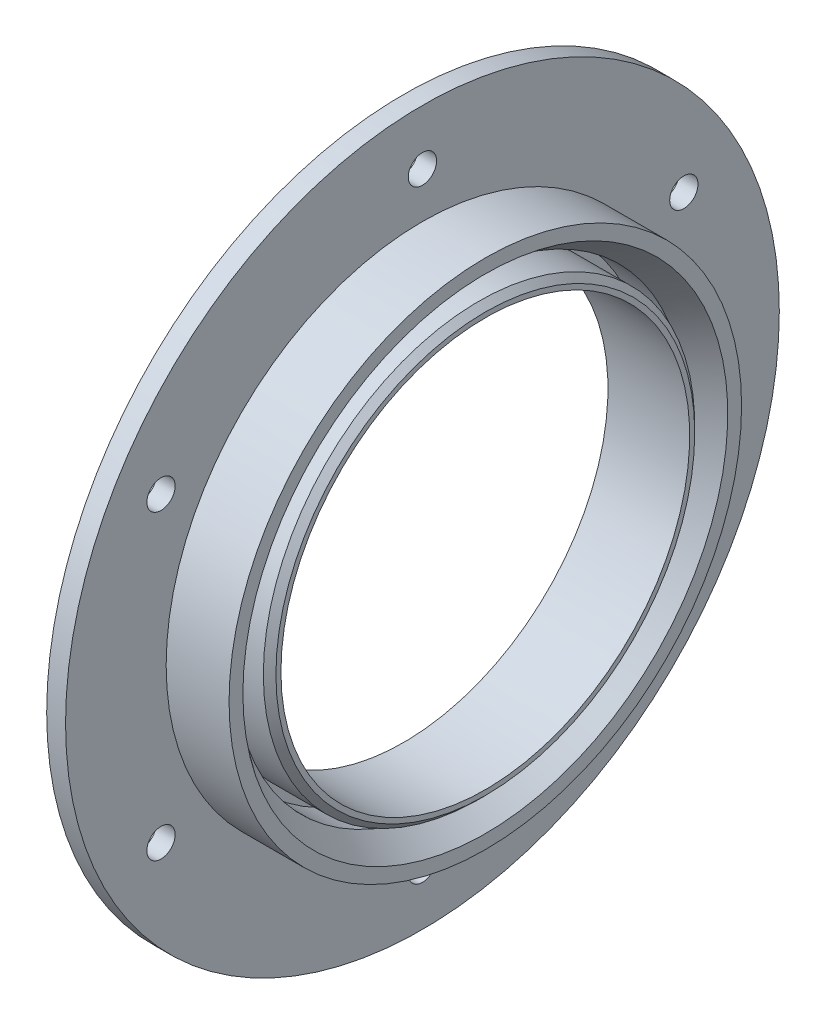
ISO-10303-21;
HEADER;
FILE_DESCRIPTION(('STEP AP214'),'2;1');
FILE_NAME('part.step','',(''),(''),'','','');
FILE_SCHEMA(('AUTOMOTIVE_DESIGN { 1 0 10303 214 1 1 1 1 }'));
ENDSEC;
DATA;
#1=APPLICATION_CONTEXT('core data for automotive mechanical design processes');
#2=APPLICATION_PROTOCOL_DEFINITION('international standard','automotive_design',2000,#1);
#3=PRODUCT_CONTEXT('',#1,'mechanical');
#4=PRODUCT('Part','Part','',(#3));
#5=PRODUCT_RELATED_PRODUCT_CATEGORY('part','',(#4));
#6=PRODUCT_DEFINITION_FORMATION('','',#4);
#7=PRODUCT_DEFINITION_CONTEXT('part definition',#1,'design');
#8=PRODUCT_DEFINITION('design','',#6,#7);
#9=PRODUCT_DEFINITION_SHAPE('','',#8);
#10=(LENGTH_UNIT() NAMED_UNIT(*) SI_UNIT(.MILLI.,.METRE.));
#11=(NAMED_UNIT(*) PLANE_ANGLE_UNIT() SI_UNIT($,.RADIAN.));
#12=(NAMED_UNIT(*) SI_UNIT($,.STERADIAN.) SOLID_ANGLE_UNIT());
#13=UNCERTAINTY_MEASURE_WITH_UNIT(LENGTH_MEASURE(1.E-05),#10,'distance_accuracy_value','');
#14=(GEOMETRIC_REPRESENTATION_CONTEXT(3) GLOBAL_UNCERTAINTY_ASSIGNED_CONTEXT((#13)) GLOBAL_UNIT_ASSIGNED_CONTEXT((#10,
#11,#12)) REPRESENTATION_CONTEXT('',''));
#15=CARTESIAN_POINT('',(0.,0.,0.));
#16=DIRECTION('',(0.,0.,1.));
#17=DIRECTION('',(1.,0.,0.));
#18=AXIS2_PLACEMENT_3D('',#15,#16,#17);
#19=CARTESIAN_POINT('',(0.,56.75,0.));
#20=DIRECTION('',(1.,0.,0.));
#21=DIRECTION('',(0.,0.,-1.));
#22=AXIS2_PLACEMENT_3D('',#19,#20,#21);
#23=PLANE('',#22);
#24=CARTESIAN_POINT('',(0.,24.0000000000005,41.5692193816528));
#25=DIRECTION('',(1.,0.,0.));
#26=DIRECTION('',(0.,0.,-1.));
#27=AXIS2_PLACEMENT_3D('',#24,#25,#26);
#28=CIRCLE('',#27,2.25);
#29=CARTESIAN_POINT('',(0.,24.0000000000005,39.3192193816528));
#30=VERTEX_POINT('',#29);
#31=EDGE_CURVE('E107',#30,#30,#28,.T.);
#32=ORIENTED_EDGE('',*,*,#31,.T.);
#33=EDGE_LOOP('',(#32));
#34=FACE_BOUND('',#33,.T.);
#35=CARTESIAN_POINT('',(0.,-23.9999999999996,41.5692193816533));
#36=DIRECTION('',(1.,0.,0.));
#37=DIRECTION('',(0.,0.,-1.));
#38=AXIS2_PLACEMENT_3D('',#35,#36,#37);
#39=CIRCLE('',#38,2.25);
#40=CARTESIAN_POINT('',(0.,-23.9999999999996,39.3192193816533));
#41=VERTEX_POINT('',#40);
#42=EDGE_CURVE('E101',#41,#41,#39,.T.);
#43=ORIENTED_EDGE('',*,*,#42,.T.);
#44=EDGE_LOOP('',(#43));
#45=FACE_BOUND('',#44,.T.);
#46=CARTESIAN_POINT('',(0.,-48.,0.));
#47=DIRECTION('',(1.,0.,0.));
#48=DIRECTION('',(0.,0.,-1.));
#49=AXIS2_PLACEMENT_3D('',#46,#47,#48);
#50=CIRCLE('',#49,2.25);
#51=CARTESIAN_POINT('',(0.,-48.,-2.25));
#52=VERTEX_POINT('',#51);
#53=EDGE_CURVE('E95',#52,#52,#50,.T.);
#54=ORIENTED_EDGE('',*,*,#53,.T.);
#55=EDGE_LOOP('',(#54));
#56=FACE_BOUND('',#55,.T.);
#57=CARTESIAN_POINT('',(0.,-24.0000000000002,-41.5692193816529));
#58=DIRECTION('',(1.,0.,0.));
#59=DIRECTION('',(0.,0.,-1.));
#60=AXIS2_PLACEMENT_3D('',#57,#58,#59);
#61=CIRCLE('',#60,2.25);
#62=CARTESIAN_POINT('',(0.,-24.0000000000002,-43.8192193816529));
#63=VERTEX_POINT('',#62);
#64=EDGE_CURVE('E89',#63,#63,#61,.T.);
#65=ORIENTED_EDGE('',*,*,#64,.T.);
#66=EDGE_LOOP('',(#65));
#67=FACE_BOUND('',#66,.T.);
#68=CARTESIAN_POINT('',(0.,23.9999999999999,-41.5692193816531));
#69=DIRECTION('',(1.,0.,0.));
#70=DIRECTION('',(0.,0.,-1.));
#71=AXIS2_PLACEMENT_3D('',#68,#69,#70);
#72=CIRCLE('',#71,2.25);
#73=CARTESIAN_POINT('',(0.,23.9999999999999,-43.8192193816531));
#74=VERTEX_POINT('',#73);
#75=EDGE_CURVE('E83',#74,#74,#72,.T.);
#76=ORIENTED_EDGE('',*,*,#75,.T.);
#77=EDGE_LOOP('',(#76));
#78=FACE_BOUND('',#77,.T.);
#79=CARTESIAN_POINT('',(0.,48.,0.));
#80=DIRECTION('',(1.,0.,0.));
#81=DIRECTION('',(0.,0.,-1.));
#82=AXIS2_PLACEMENT_3D('',#79,#80,#81);
#83=CIRCLE('',#82,2.25);
#84=CARTESIAN_POINT('',(0.,48.,-2.25));
#85=VERTEX_POINT('',#84);
#86=EDGE_CURVE('E77',#85,#85,#83,.T.);
#87=ORIENTED_EDGE('',*,*,#86,.T.);
#88=EDGE_LOOP('',(#87));
#89=FACE_BOUND('',#88,.T.);
#90=CARTESIAN_POINT('',(0.,0.,0.));
#91=DIRECTION('',(-1.,0.,0.));
#92=DIRECTION('',(0.,0.,1.));
#93=AXIS2_PLACEMENT_3D('',#90,#91,#92);
#94=CIRCLE('',#93,32.5);
#95=CARTESIAN_POINT('',(0.,0.,32.5));
#96=VERTEX_POINT('',#95);
#97=EDGE_CURVE('E53',#96,#96,#94,.T.);
#98=ORIENTED_EDGE('',*,*,#97,.F.);
#99=EDGE_LOOP('',(#98));
#100=FACE_BOUND('',#99,.T.);
#101=CARTESIAN_POINT('',(0.,0.,0.));
#102=DIRECTION('',(-1.,0.,0.));
#103=DIRECTION('',(0.,0.,1.));
#104=AXIS2_PLACEMENT_3D('',#101,#102,#103);
#105=CIRCLE('',#104,56.75);
#106=CARTESIAN_POINT('',(0.,0.,56.75));
#107=VERTEX_POINT('',#106);
#108=EDGE_CURVE('E74',#107,#107,#105,.T.);
#109=ORIENTED_EDGE('',*,*,#108,.T.);
#110=EDGE_LOOP('',(#109));
#111=FACE_BOUND('',#110,.T.);
#112=ADVANCED_FACE('F33',(#34,#45,#56,#67,#78,#89,#100,#111),#23,.F.);
#113=CARTESIAN_POINT('',(0.,0.,0.));
#114=DIRECTION('',(-1.,0.,0.));
#115=DIRECTION('',(0.,0.,1.));
#116=AXIS2_PLACEMENT_3D('',#113,#114,#115);
#117=CYLINDRICAL_SURFACE('',#116,32.5);
#118=CARTESIAN_POINT('',(13.,0.,0.));
#119=DIRECTION('',(-1.,0.,0.));
#120=DIRECTION('',(0.,0.,1.));
#121=AXIS2_PLACEMENT_3D('',#118,#119,#120);
#122=CIRCLE('',#121,32.5);
#123=CARTESIAN_POINT('',(13.,0.,32.5));
#124=VERTEX_POINT('',#123);
#125=EDGE_CURVE('E56',#124,#124,#122,.T.);
#126=ORIENTED_EDGE('',*,*,#125,.F.);
#127=EDGE_LOOP('',(#126));
#128=FACE_BOUND('',#127,.T.);
#129=ORIENTED_EDGE('',*,*,#97,.T.);
#130=EDGE_LOOP('',(#129));
#131=FACE_BOUND('',#130,.T.);
#132=ADVANCED_FACE('F154',(#128,#131),#117,.F.);
#133=CARTESIAN_POINT('',(13.,32.5,0.));
#134=DIRECTION('',(-1.,0.,0.));
#135=DIRECTION('',(0.,0.,1.));
#136=AXIS2_PLACEMENT_3D('',#133,#134,#135);
#137=PLANE('',#136);
#138=CARTESIAN_POINT('',(13.,0.,0.));
#139=DIRECTION('',(-1.,0.,0.));
#140=DIRECTION('',(0.,0.,1.));
#141=AXIS2_PLACEMENT_3D('',#138,#139,#140);
#142=CIRCLE('',#141,33.3);
#143=CARTESIAN_POINT('',(13.,0.,33.3));
#144=VERTEX_POINT('',#143);
#145=EDGE_CURVE('E10',#144,#144,#142,.F.);
#146=ORIENTED_EDGE('',*,*,#145,.T.);
#147=EDGE_LOOP('',(#146));
#148=FACE_BOUND('',#147,.T.);
#149=ORIENTED_EDGE('',*,*,#125,.T.);
#150=EDGE_LOOP('',(#149));
#151=FACE_BOUND('',#150,.T.);
#152=ADVANCED_FACE('F160',(#148,#151),#137,.F.);
#153=CARTESIAN_POINT('',(0.,0.,0.));
#154=DIRECTION('',(-1.,0.,0.));
#155=DIRECTION('',(0.,0.,1.));
#156=AXIS2_PLACEMENT_3D('',#153,#154,#155);
#157=CYLINDRICAL_SURFACE('',#156,34.3);
#158=CARTESIAN_POINT('',(12.,0.,0.));
#159=DIRECTION('',(-1.,0.,0.));
#160=DIRECTION('',(0.,0.,1.));
#161=AXIS2_PLACEMENT_3D('',#158,#159,#160);
#162=CIRCLE('',#161,34.3);
#163=CARTESIAN_POINT('',(12.,0.,34.3));
#164=VERTEX_POINT('',#163);
#165=EDGE_CURVE('E40',#164,#164,#162,.T.);
#166=ORIENTED_EDGE('',*,*,#165,.T.);
#167=EDGE_LOOP('',(#166));
#168=FACE_BOUND('',#167,.T.);
#169=CARTESIAN_POINT('',(2.99999999999999,0.,0.));
#170=DIRECTION('',(-1.,0.,0.));
#171=DIRECTION('',(0.,0.,1.));
#172=AXIS2_PLACEMENT_3D('',#169,#170,#171);
#173=CIRCLE('',#172,34.3);
#174=CARTESIAN_POINT('',(2.99999999999999,0.,34.3));
#175=VERTEX_POINT('',#174);
#176=EDGE_CURVE('E59',#175,#175,#173,.T.);
#177=ORIENTED_EDGE('',*,*,#176,.F.);
#178=EDGE_LOOP('',(#177));
#179=FACE_BOUND('',#178,.T.);
#180=ADVANCED_FACE('F184',(#168,#179),#157,.T.);
#181=CARTESIAN_POINT('',(2.99999999999999,34.3,0.));
#182=DIRECTION('',(-1.,0.,0.));
#183=DIRECTION('',(0.,0.,1.));
#184=AXIS2_PLACEMENT_3D('',#181,#182,#183);
#185=PLANE('',#184);
#186=CARTESIAN_POINT('',(3.,0.,0.));
#187=DIRECTION('',(-1.,0.,0.));
#188=DIRECTION('',(0.,0.,1.));
#189=AXIS2_PLACEMENT_3D('',#186,#187,#188);
#190=CIRCLE('',#189,35.75);
#191=CARTESIAN_POINT('',(3.,0.,35.75));
#192=VERTEX_POINT('',#191);
#193=EDGE_CURVE('E62',#192,#192,#190,.T.);
#194=ORIENTED_EDGE('',*,*,#193,.F.);
#195=EDGE_LOOP('',(#194));
#196=FACE_BOUND('',#195,.T.);
#197=ORIENTED_EDGE('',*,*,#176,.T.);
#198=EDGE_LOOP('',(#197));
#199=FACE_BOUND('',#198,.T.);
#200=ADVANCED_FACE('F150',(#196,#199),#185,.F.);
#201=CARTESIAN_POINT('',(0.,0.,0.));
#202=DIRECTION('',(-1.,0.,0.));
#203=DIRECTION('',(0.,0.,1.));
#204=AXIS2_PLACEMENT_3D('',#201,#202,#203);
#205=CYLINDRICAL_SURFACE('',#204,35.75);
#206=CARTESIAN_POINT('',(8.99999999999997,0.,0.));
#207=DIRECTION('',(-1.,0.,0.));
#208=DIRECTION('',(0.,0.,1.));
#209=AXIS2_PLACEMENT_3D('',#206,#207,#208);
#210=CIRCLE('',#209,35.75);
#211=CARTESIAN_POINT('',(8.99999999999997,0.,35.75));
#212=VERTEX_POINT('',#211);
#213=EDGE_CURVE('E44',#212,#212,#210,.F.);
#214=ORIENTED_EDGE('',*,*,#213,.T.);
#215=EDGE_LOOP('',(#214));
#216=FACE_BOUND('',#215,.T.);
#217=ORIENTED_EDGE('',*,*,#193,.T.);
#218=EDGE_LOOP('',(#217));
#219=FACE_BOUND('',#218,.T.);
#220=ADVANCED_FACE('F144',(#216,#219),#205,.F.);
#221=CARTESIAN_POINT('',(13.,35.75,0.));
#222=DIRECTION('',(-1.,0.,0.));
#223=DIRECTION('',(0.,0.,1.));
#224=AXIS2_PLACEMENT_3D('',#221,#222,#223);
#225=PLANE('',#224);
#226=CARTESIAN_POINT('',(13.,0.,0.));
#227=DIRECTION('',(-1.,0.,0.));
#228=DIRECTION('',(0.,0.,1.));
#229=AXIS2_PLACEMENT_3D('',#226,#227,#228);
#230=CIRCLE('',#229,38.5508301528388);
#231=CARTESIAN_POINT('',(13.,0.,38.5508301528388));
#232=VERTEX_POINT('',#231);
#233=EDGE_CURVE('E48',#232,#232,#230,.T.);
#234=ORIENTED_EDGE('',*,*,#233,.T.);
#235=EDGE_LOOP('',(#234));
#236=FACE_BOUND('',#235,.T.);
#237=CARTESIAN_POINT('',(13.,0.,0.));
#238=DIRECTION('',(-1.,0.,0.));
#239=DIRECTION('',(0.,0.,1.));
#240=AXIS2_PLACEMENT_3D('',#237,#238,#239);
#241=CIRCLE('',#240,40.75);
#242=CARTESIAN_POINT('',(13.,0.,40.75));
#243=VERTEX_POINT('',#242);
#244=EDGE_CURVE('E65',#243,#243,#241,.T.);
#245=ORIENTED_EDGE('',*,*,#244,.F.);
#246=EDGE_LOOP('',(#245));
#247=FACE_BOUND('',#246,.T.);
#248=ADVANCED_FACE('F139',(#236,#247),#225,.F.);
#249=CARTESIAN_POINT('',(0.,0.,0.));
#250=DIRECTION('',(-1.,0.,0.));
#251=DIRECTION('',(0.,0.,1.));
#252=AXIS2_PLACEMENT_3D('',#249,#250,#251);
#253=CYLINDRICAL_SURFACE('',#252,40.75);
#254=CARTESIAN_POINT('',(3.,0.,0.));
#255=DIRECTION('',(-1.,0.,0.));
#256=DIRECTION('',(0.,0.,1.));
#257=AXIS2_PLACEMENT_3D('',#254,#255,#256);
#258=CIRCLE('',#257,40.75);
#259=CARTESIAN_POINT('',(3.,0.,40.75));
#260=VERTEX_POINT('',#259);
#261=EDGE_CURVE('E68',#260,#260,#258,.T.);
#262=ORIENTED_EDGE('',*,*,#261,.F.);
#263=EDGE_LOOP('',(#262));
#264=FACE_BOUND('',#263,.T.);
#265=ORIENTED_EDGE('',*,*,#244,.T.);
#266=EDGE_LOOP('',(#265));
#267=FACE_BOUND('',#266,.T.);
#268=ADVANCED_FACE('F121',(#264,#267),#253,.T.);
#269=CARTESIAN_POINT('',(3.,40.75,0.));
#270=DIRECTION('',(-1.,0.,0.));
#271=DIRECTION('',(0.,0.,1.));
#272=AXIS2_PLACEMENT_3D('',#269,#270,#271);
#273=PLANE('',#272);
#274=CARTESIAN_POINT('',(3.,24.0000000000005,41.5692193816528));
#275=DIRECTION('',(1.,0.,0.));
#276=DIRECTION('',(0.,0.866025403784433,-0.50000000000001));
#277=AXIS2_PLACEMENT_3D('',#274,#275,#276);
#278=CIRCLE('',#277,2.25);
#279=CARTESIAN_POINT('',(3.,25.9485571585155,40.4442193816528));
#280=VERTEX_POINT('',#279);
#281=EDGE_CURVE('E110',#280,#280,#278,.T.);
#282=ORIENTED_EDGE('',*,*,#281,.F.);
#283=EDGE_LOOP('',(#282));
#284=FACE_BOUND('',#283,.T.);
#285=CARTESIAN_POINT('',(3.,-23.9999999999996,41.5692193816533));
#286=DIRECTION('',(1.,0.,0.));
#287=DIRECTION('',(0.,0.866025403784443,0.499999999999992));
#288=AXIS2_PLACEMENT_3D('',#285,#286,#287);
#289=CIRCLE('',#288,2.25);
#290=CARTESIAN_POINT('',(3.,-22.0514428414846,42.6942193816533));
#291=VERTEX_POINT('',#290);
#292=EDGE_CURVE('E104',#291,#291,#289,.T.);
#293=ORIENTED_EDGE('',*,*,#292,.F.);
#294=EDGE_LOOP('',(#293));
#295=FACE_BOUND('',#294,.T.);
#296=CARTESIAN_POINT('',(3.,-48.,0.));
#297=DIRECTION('',(1.,0.,0.));
#298=DIRECTION('',(0.,0.,1.));
#299=AXIS2_PLACEMENT_3D('',#296,#297,#298);
#300=CIRCLE('',#299,2.25);
#301=CARTESIAN_POINT('',(3.,-48.,2.25));
#302=VERTEX_POINT('',#301);
#303=EDGE_CURVE('E98',#302,#302,#300,.T.);
#304=ORIENTED_EDGE('',*,*,#303,.F.);
#305=EDGE_LOOP('',(#304));
#306=FACE_BOUND('',#305,.T.);
#307=CARTESIAN_POINT('',(3.,-24.0000000000002,-41.5692193816529));
#308=DIRECTION('',(1.,0.,0.));
#309=DIRECTION('',(0.,-0.866025403784436,0.500000000000004));
#310=AXIS2_PLACEMENT_3D('',#307,#308,#309);
#311=CIRCLE('',#310,2.25);
#312=CARTESIAN_POINT('',(3.,-25.9485571585152,-40.4442193816529));
#313=VERTEX_POINT('',#312);
#314=EDGE_CURVE('E92',#313,#313,#311,.T.);
#315=ORIENTED_EDGE('',*,*,#314,.F.);
#316=EDGE_LOOP('',(#315));
#317=FACE_BOUND('',#316,.T.);
#318=CARTESIAN_POINT('',(3.,23.9999999999999,-41.5692193816531));
#319=DIRECTION('',(1.,0.,0.));
#320=DIRECTION('',(0.,-0.86602540378444,-0.499999999999998));
#321=AXIS2_PLACEMENT_3D('',#318,#319,#320);
#322=CIRCLE('',#321,2.25);
#323=CARTESIAN_POINT('',(3.,22.0514428414849,-42.6942193816531));
#324=VERTEX_POINT('',#323);
#325=EDGE_CURVE('E86',#324,#324,#322,.T.);
#326=ORIENTED_EDGE('',*,*,#325,.F.);
#327=EDGE_LOOP('',(#326));
#328=FACE_BOUND('',#327,.T.);
#329=CARTESIAN_POINT('',(3.,48.,0.));
#330=DIRECTION('',(1.,0.,0.));
#331=DIRECTION('',(0.,0.,-1.));
#332=AXIS2_PLACEMENT_3D('',#329,#330,#331);
#333=CIRCLE('',#332,2.25);
#334=CARTESIAN_POINT('',(3.,48.,-2.25));
#335=VERTEX_POINT('',#334);
#336=EDGE_CURVE('E80',#335,#335,#333,.T.);
#337=ORIENTED_EDGE('',*,*,#336,.F.);
#338=EDGE_LOOP('',(#337));
#339=FACE_BOUND('',#338,.T.);
#340=CARTESIAN_POINT('',(3.,0.,0.));
#341=DIRECTION('',(-1.,0.,0.));
#342=DIRECTION('',(0.,0.,1.));
#343=AXIS2_PLACEMENT_3D('',#340,#341,#342);
#344=CIRCLE('',#343,56.75);
#345=CARTESIAN_POINT('',(3.,0.,56.75));
#346=VERTEX_POINT('',#345);
#347=EDGE_CURVE('E71',#346,#346,#344,.T.);
#348=ORIENTED_EDGE('',*,*,#347,.F.);
#349=EDGE_LOOP('',(#348));
#350=FACE_BOUND('',#349,.T.);
#351=ORIENTED_EDGE('',*,*,#261,.T.);
#352=EDGE_LOOP('',(#351));
#353=FACE_BOUND('',#352,.T.);
#354=ADVANCED_FACE('F117',(#284,#295,#306,#317,#328,#339,#350,#353),#273,.F.);
#355=CARTESIAN_POINT('',(0.,0.,0.));
#356=DIRECTION('',(-1.,0.,0.));
#357=DIRECTION('',(0.,0.,1.));
#358=AXIS2_PLACEMENT_3D('',#355,#356,#357);
#359=CYLINDRICAL_SURFACE('',#358,56.75);
#360=ORIENTED_EDGE('',*,*,#108,.F.);
#361=EDGE_LOOP('',(#360));
#362=FACE_BOUND('',#361,.T.);
#363=ORIENTED_EDGE('',*,*,#347,.T.);
#364=EDGE_LOOP('',(#363));
#365=FACE_BOUND('',#364,.T.);
#366=ADVANCED_FACE('F120',(#362,#365),#359,.T.);
#367=CARTESIAN_POINT('',(13.,0.,0.));
#368=DIRECTION('',(1.,0.,0.));
#369=DIRECTION('',(0.,0.,-1.));
#370=AXIS2_PLACEMENT_3D('',#367,#368,#369);
#371=CONICAL_SURFACE('',#370,38.5508301528388,0.610865238198012);
#372=ORIENTED_EDGE('',*,*,#213,.F.);
#373=EDGE_LOOP('',(#372));
#374=FACE_BOUND('',#373,.T.);
#375=ORIENTED_EDGE('',*,*,#233,.F.);
#376=EDGE_LOOP('',(#375));
#377=FACE_BOUND('',#376,.T.);
#378=ADVANCED_FACE('F165',(#374,#377),#371,.F.);
#379=CARTESIAN_POINT('',(12.,0.,0.));
#380=DIRECTION('',(-1.,0.,0.));
#381=DIRECTION('',(0.,0.,1.));
#382=AXIS2_PLACEMENT_3D('',#379,#380,#381);
#383=CONICAL_SURFACE('',#382,34.3,0.785398163397445);
#384=ORIENTED_EDGE('',*,*,#145,.F.);
#385=EDGE_LOOP('',(#384));
#386=FACE_BOUND('',#385,.T.);
#387=ORIENTED_EDGE('',*,*,#165,.F.);
#388=EDGE_LOOP('',(#387));
#389=FACE_BOUND('',#388,.T.);
#390=ADVANCED_FACE('F35',(#386,#389),#383,.T.);
#391=CARTESIAN_POINT('',(-7.,48.,0.));
#392=DIRECTION('',(1.,0.,0.));
#393=DIRECTION('',(0.,0.,-1.));
#394=AXIS2_PLACEMENT_3D('',#391,#392,#393);
#395=CYLINDRICAL_SURFACE('',#394,2.25);
#396=ORIENTED_EDGE('',*,*,#336,.T.);
#397=EDGE_LOOP('',(#396));
#398=FACE_BOUND('',#397,.T.);
#399=ORIENTED_EDGE('',*,*,#86,.F.);
#400=EDGE_LOOP('',(#399));
#401=FACE_BOUND('',#400,.T.);
#402=ADVANCED_FACE('F172',(#398,#401),#395,.F.);
#403=CARTESIAN_POINT('',(-7.,23.9999999999999,-41.5692193816531));
#404=DIRECTION('',(1.,0.,0.));
#405=DIRECTION('',(0.,0.,-1.));
#406=AXIS2_PLACEMENT_3D('',#403,#404,#405);
#407=CYLINDRICAL_SURFACE('',#406,2.25);
#408=ORIENTED_EDGE('',*,*,#325,.T.);
#409=EDGE_LOOP('',(#408));
#410=FACE_BOUND('',#409,.T.);
#411=ORIENTED_EDGE('',*,*,#75,.F.);
#412=EDGE_LOOP('',(#411));
#413=FACE_BOUND('',#412,.T.);
#414=ADVANCED_FACE('F257',(#410,#413),#407,.F.);
#415=CARTESIAN_POINT('',(-7.,-24.0000000000002,-41.5692193816529));
#416=DIRECTION('',(1.,0.,0.));
#417=DIRECTION('',(0.,0.,-1.));
#418=AXIS2_PLACEMENT_3D('',#415,#416,#417);
#419=CYLINDRICAL_SURFACE('',#418,2.25);
#420=ORIENTED_EDGE('',*,*,#314,.T.);
#421=EDGE_LOOP('',(#420));
#422=FACE_BOUND('',#421,.T.);
#423=ORIENTED_EDGE('',*,*,#64,.F.);
#424=EDGE_LOOP('',(#423));
#425=FACE_BOUND('',#424,.T.);
#426=ADVANCED_FACE('F266',(#422,#425),#419,.F.);
#427=CARTESIAN_POINT('',(-7.,-48.,0.));
#428=DIRECTION('',(1.,0.,0.));
#429=DIRECTION('',(0.,0.,-1.));
#430=AXIS2_PLACEMENT_3D('',#427,#428,#429);
#431=CYLINDRICAL_SURFACE('',#430,2.25);
#432=ORIENTED_EDGE('',*,*,#303,.T.);
#433=EDGE_LOOP('',(#432));
#434=FACE_BOUND('',#433,.T.);
#435=ORIENTED_EDGE('',*,*,#53,.F.);
#436=EDGE_LOOP('',(#435));
#437=FACE_BOUND('',#436,.T.);
#438=ADVANCED_FACE('F276',(#434,#437),#431,.F.);
#439=CARTESIAN_POINT('',(-7.,-23.9999999999996,41.5692193816533));
#440=DIRECTION('',(1.,0.,0.));
#441=DIRECTION('',(0.,0.,-1.));
#442=AXIS2_PLACEMENT_3D('',#439,#440,#441);
#443=CYLINDRICAL_SURFACE('',#442,2.25);
#444=ORIENTED_EDGE('',*,*,#292,.T.);
#445=EDGE_LOOP('',(#444));
#446=FACE_BOUND('',#445,.T.);
#447=ORIENTED_EDGE('',*,*,#42,.F.);
#448=EDGE_LOOP('',(#447));
#449=FACE_BOUND('',#448,.T.);
#450=ADVANCED_FACE('F285',(#446,#449),#443,.F.);
#451=CARTESIAN_POINT('',(-7.,24.0000000000005,41.5692193816528));
#452=DIRECTION('',(1.,0.,0.));
#453=DIRECTION('',(0.,0.,-1.));
#454=AXIS2_PLACEMENT_3D('',#451,#452,#453);
#455=CYLINDRICAL_SURFACE('',#454,2.25);
#456=ORIENTED_EDGE('',*,*,#281,.T.);
#457=EDGE_LOOP('',(#456));
#458=FACE_BOUND('',#457,.T.);
#459=ORIENTED_EDGE('',*,*,#31,.F.);
#460=EDGE_LOOP('',(#459));
#461=FACE_BOUND('',#460,.T.);
#462=ADVANCED_FACE('F114',(#458,#461),#455,.F.);
#463=CLOSED_SHELL('',(#112,#132,#152,#180,#200,#220,#248,#268,#354,#366,#378,#390,#402,#414,
#426,#438,#450,#462));
#464=MANIFOLD_SOLID_BREP('B2',#463);
#465=ADVANCED_BREP_SHAPE_REPRESENTATION('',(#18,#464),#14);
#466=SHAPE_DEFINITION_REPRESENTATION(#9,#465);
ENDSEC;
END-ISO-10303-21;
